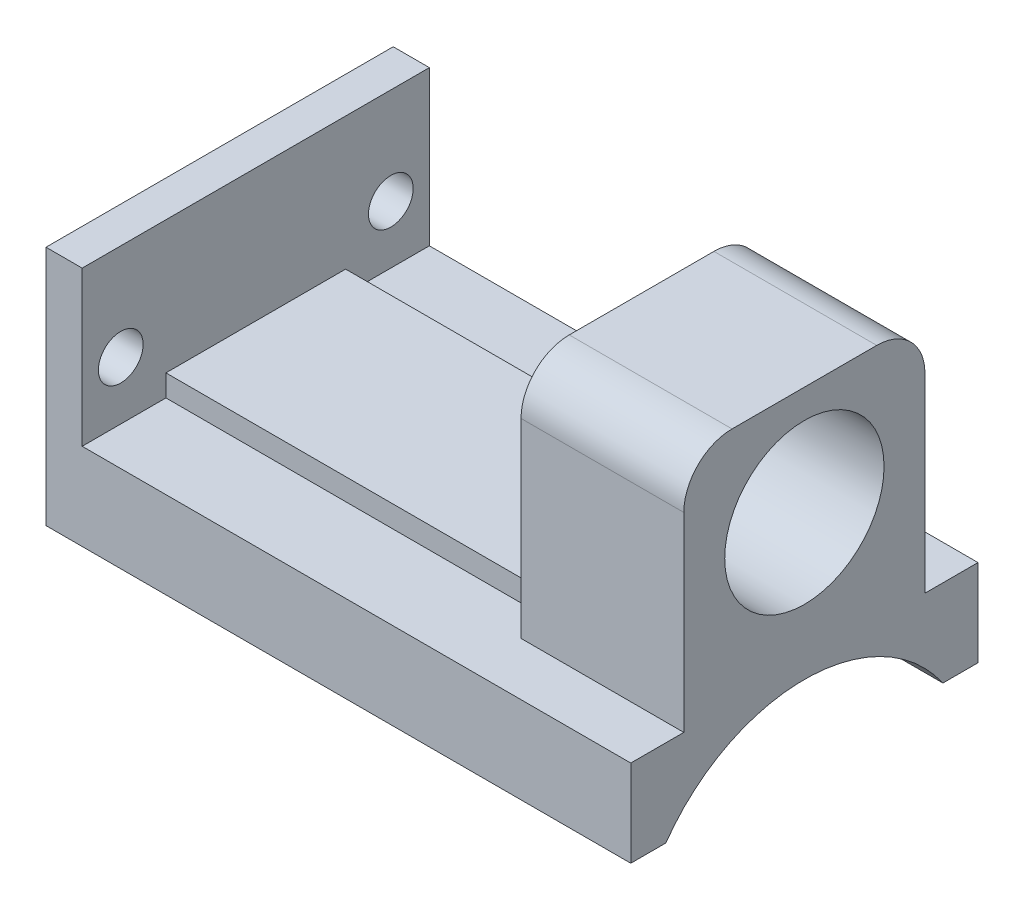
ISO-10303-21;
HEADER;
FILE_DESCRIPTION(('STEP AP214'),'2;1');
FILE_NAME('part.step','',(''),(''),'','','');
FILE_SCHEMA(('AUTOMOTIVE_DESIGN { 1 0 10303 214 1 1 1 1 }'));
ENDSEC;
DATA;
#1=APPLICATION_CONTEXT('core data for automotive mechanical design processes');
#2=APPLICATION_PROTOCOL_DEFINITION('international standard','automotive_design',2000,#1);
#3=PRODUCT_CONTEXT('',#1,'mechanical');
#4=PRODUCT('Part','Part','',(#3));
#5=PRODUCT_RELATED_PRODUCT_CATEGORY('part','',(#4));
#6=PRODUCT_DEFINITION_FORMATION('','',#4);
#7=PRODUCT_DEFINITION_CONTEXT('part definition',#1,'design');
#8=PRODUCT_DEFINITION('design','',#6,#7);
#9=PRODUCT_DEFINITION_SHAPE('','',#8);
#10=(LENGTH_UNIT() NAMED_UNIT(*) SI_UNIT(.MILLI.,.METRE.));
#11=(NAMED_UNIT(*) PLANE_ANGLE_UNIT() SI_UNIT($,.RADIAN.));
#12=(NAMED_UNIT(*) SI_UNIT($,.STERADIAN.) SOLID_ANGLE_UNIT());
#13=UNCERTAINTY_MEASURE_WITH_UNIT(LENGTH_MEASURE(1.E-05),#10,'distance_accuracy_value','');
#14=(GEOMETRIC_REPRESENTATION_CONTEXT(3) GLOBAL_UNCERTAINTY_ASSIGNED_CONTEXT((#13)) GLOBAL_UNIT_ASSIGNED_CONTEXT((#10,
#11,#12)) REPRESENTATION_CONTEXT('',''));
#15=CARTESIAN_POINT('',(0.,0.,0.));
#16=DIRECTION('',(0.,0.,1.));
#17=DIRECTION('',(1.,0.,0.));
#18=AXIS2_PLACEMENT_3D('',#15,#16,#17);
#19=CARTESIAN_POINT('',(38.50005,2.38125,-5.91581970326276));
#20=DIRECTION('',(0.,0.,1.));
#21=DIRECTION('',(1.,0.,0.));
#22=AXIS2_PLACEMENT_3D('',#19,#20,#21);
#23=PLANE('',#22);
#24=DIRECTION('',(0.,-1.,0.));
#25=VECTOR('',#24,1.);
#26=CARTESIAN_POINT('',(27.78125,0.952500000000002,-5.91581970326276));
#27=LINE('',#26,#25);
#28=CARTESIAN_POINT('',(27.78125,2.38125,-5.91581970326276));
#29=VERTEX_POINT('',#28);
#30=CARTESIAN_POINT('',(27.78125,0.952500000000002,-5.91581970326276));
#31=VERTEX_POINT('',#30);
#32=EDGE_CURVE('E620',#29,#31,#27,.T.);
#33=ORIENTED_EDGE('',*,*,#32,.T.);
#34=DIRECTION('',(-1.,0.,0.));
#35=VECTOR('',#34,1.);
#36=CARTESIAN_POINT('',(38.50005,0.952500000000002,-5.91581970326276));
#37=LINE('',#36,#35);
#38=CARTESIAN_POINT('',(2.38125,0.952500000000002,-5.91581970326276));
#39=VERTEX_POINT('',#38);
#40=EDGE_CURVE('E538',#31,#39,#37,.T.);
#41=ORIENTED_EDGE('',*,*,#40,.T.);
#42=DIRECTION('',(0.,1.,0.));
#43=VECTOR('',#42,1.);
#44=CARTESIAN_POINT('',(2.38125,2.38125,-5.91581970326276));
#45=LINE('',#44,#43);
#46=CARTESIAN_POINT('',(2.38125,2.38125,-5.91581970326276));
#47=VERTEX_POINT('',#46);
#48=EDGE_CURVE('E640',#39,#47,#45,.T.);
#49=ORIENTED_EDGE('',*,*,#48,.T.);
#50=DIRECTION('',(-1.,0.,0.));
#51=VECTOR('',#50,1.);
#52=CARTESIAN_POINT('',(38.50005,2.38125,-5.91581970326276));
#53=LINE('',#52,#51);
#54=EDGE_CURVE('E536',#29,#47,#53,.T.);
#55=ORIENTED_EDGE('',*,*,#54,.F.);
#56=EDGE_LOOP('',(#33,#41,#49,#55));
#57=FACE_BOUND('',#56,.T.);
#58=ADVANCED_FACE('F360',(#57),#23,.F.);
#59=CARTESIAN_POINT('',(38.50005,2.38125,5.91581970326276));
#60=DIRECTION('',(0.,-1.,0.));
#61=DIRECTION('',(0.,0.,-1.));
#62=AXIS2_PLACEMENT_3D('',#59,#60,#61);
#63=PLANE('',#62);
#64=DIRECTION('',(0.,0.,-1.));
#65=VECTOR('',#64,1.);
#66=CARTESIAN_POINT('',(27.78125,2.38125,-5.91581970326276));
#67=LINE('',#66,#65);
#68=CARTESIAN_POINT('',(27.78125,2.38125,5.91581970326276));
#69=VERTEX_POINT('',#68);
#70=EDGE_CURVE('E507',#69,#29,#67,.T.);
#71=ORIENTED_EDGE('',*,*,#70,.T.);
#72=ORIENTED_EDGE('',*,*,#54,.T.);
#73=DIRECTION('',(0.,0.,1.));
#74=VECTOR('',#73,1.);
#75=CARTESIAN_POINT('',(2.38125,2.38125,5.91581970326276));
#76=LINE('',#75,#74);
#77=CARTESIAN_POINT('',(2.38125,2.38125,5.91581970326276));
#78=VERTEX_POINT('',#77);
#79=EDGE_CURVE('E643',#47,#78,#76,.T.);
#80=ORIENTED_EDGE('',*,*,#79,.T.);
#81=DIRECTION('',(-1.,0.,0.));
#82=VECTOR('',#81,1.);
#83=CARTESIAN_POINT('',(38.50005,2.38125,5.91581970326276));
#84=LINE('',#83,#82);
#85=EDGE_CURVE('E534',#69,#78,#84,.T.);
#86=ORIENTED_EDGE('',*,*,#85,.F.);
#87=EDGE_LOOP('',(#71,#72,#80,#86));
#88=FACE_BOUND('',#87,.T.);
#89=ADVANCED_FACE('F674',(#88),#63,.F.);
#90=CARTESIAN_POINT('',(38.50005,2.38125,5.91581970326276));
#91=DIRECTION('',(0.,0.,-1.));
#92=DIRECTION('',(-1.,0.,0.));
#93=AXIS2_PLACEMENT_3D('',#90,#91,#92);
#94=PLANE('',#93);
#95=DIRECTION('',(0.,1.,0.));
#96=VECTOR('',#95,1.);
#97=CARTESIAN_POINT('',(27.78125,2.38125,5.91581970326276));
#98=LINE('',#97,#96);
#99=CARTESIAN_POINT('',(27.78125,0.952500000000001,5.91581970326276));
#100=VERTEX_POINT('',#99);
#101=EDGE_CURVE('E633',#100,#69,#98,.T.);
#102=ORIENTED_EDGE('',*,*,#101,.T.);
#103=ORIENTED_EDGE('',*,*,#85,.T.);
#104=DIRECTION('',(0.,-1.,0.));
#105=VECTOR('',#104,1.);
#106=CARTESIAN_POINT('',(2.38125,2.38125,5.91581970326276));
#107=LINE('',#106,#105);
#108=CARTESIAN_POINT('',(2.38125,0.952500000000001,5.91581970326276));
#109=VERTEX_POINT('',#108);
#110=EDGE_CURVE('E646',#78,#109,#107,.T.);
#111=ORIENTED_EDGE('',*,*,#110,.T.);
#112=DIRECTION('',(-1.,0.,0.));
#113=VECTOR('',#112,1.);
#114=CARTESIAN_POINT('',(38.50005,0.952500000000001,5.91581970326276));
#115=LINE('',#114,#113);
#116=EDGE_CURVE('E532',#100,#109,#115,.T.);
#117=ORIENTED_EDGE('',*,*,#116,.F.);
#118=EDGE_LOOP('',(#102,#103,#111,#117));
#119=FACE_BOUND('',#118,.T.);
#120=ADVANCED_FACE('F671',(#119),#94,.F.);
#121=CARTESIAN_POINT('',(2.38125,-4.7625,-11.43));
#122=DIRECTION('',(0.,0.,1.));
#123=DIRECTION('',(0.,-1.,0.));
#124=AXIS2_PLACEMENT_3D('',#121,#122,#123);
#125=PLANE('',#124);
#126=DIRECTION('',(0.,1.,0.));
#127=VECTOR('',#126,1.);
#128=CARTESIAN_POINT('',(0.,-4.7625,-11.43));
#129=LINE('',#128,#127);
#130=CARTESIAN_POINT('',(0.,-4.7625,-11.43));
#131=VERTEX_POINT('',#130);
#132=CARTESIAN_POINT('',(0.,11.1125,-11.43));
#133=VERTEX_POINT('',#132);
#134=EDGE_CURVE('E541',#131,#133,#129,.T.);
#135=ORIENTED_EDGE('',*,*,#134,.T.);
#136=DIRECTION('',(-1.,0.,0.));
#137=VECTOR('',#136,1.);
#138=CARTESIAN_POINT('',(2.38125,11.1125,-11.43));
#139=LINE('',#138,#137);
#140=CARTESIAN_POINT('',(2.38125,11.1125,-11.43));
#141=VERTEX_POINT('',#140);
#142=EDGE_CURVE('E562',#141,#133,#139,.T.);
#143=ORIENTED_EDGE('',*,*,#142,.F.);
#144=DIRECTION('',(0.,1.,0.));
#145=VECTOR('',#144,1.);
#146=CARTESIAN_POINT('',(2.38125,-4.7625,-11.43));
#147=LINE('',#146,#145);
#148=CARTESIAN_POINT('',(2.38125,0.952499999999999,-11.43));
#149=VERTEX_POINT('',#148);
#150=EDGE_CURVE('E554',#149,#141,#147,.T.);
#151=ORIENTED_EDGE('',*,*,#150,.F.);
#152=DIRECTION('',(-1.,0.,0.));
#153=VECTOR('',#152,1.);
#154=CARTESIAN_POINT('',(38.50005,0.952500000000003,-11.43));
#155=LINE('',#154,#153);
#156=CARTESIAN_POINT('',(38.50005,0.952500000000003,-11.43));
#157=VERTEX_POINT('',#156);
#158=EDGE_CURVE('E540',#157,#149,#155,.T.);
#159=ORIENTED_EDGE('',*,*,#158,.F.);
#160=DIRECTION('',(0.,1.,0.));
#161=VECTOR('',#160,1.);
#162=CARTESIAN_POINT('',(38.50005,-4.7625,-11.43));
#163=LINE('',#162,#161);
#164=CARTESIAN_POINT('',(38.50005,-4.7625,-11.43));
#165=VERTEX_POINT('',#164);
#166=EDGE_CURVE('E513',#165,#157,#163,.T.);
#167=ORIENTED_EDGE('',*,*,#166,.F.);
#168=DIRECTION('',(-1.,0.,0.));
#169=VECTOR('',#168,1.);
#170=CARTESIAN_POINT('',(2.38125,-4.7625,-11.43));
#171=LINE('',#170,#169);
#172=EDGE_CURVE('E566',#165,#131,#171,.T.);
#173=ORIENTED_EDGE('',*,*,#172,.T.);
#174=EDGE_LOOP('',(#135,#143,#151,#159,#167,#173));
#175=FACE_BOUND('',#174,.T.);
#176=ADVANCED_FACE('F362',(#175),#125,.F.);
#177=CARTESIAN_POINT('',(2.38125,11.1125,11.43));
#178=DIRECTION('',(0.,-1.,0.));
#179=DIRECTION('',(0.,0.,-1.));
#180=AXIS2_PLACEMENT_3D('',#177,#178,#179);
#181=PLANE('',#180);
#182=DIRECTION('',(0.,0.,1.));
#183=VECTOR('',#182,1.);
#184=CARTESIAN_POINT('',(0.,11.1125,11.43));
#185=LINE('',#184,#183);
#186=CARTESIAN_POINT('',(0.,11.1125,11.43));
#187=VERTEX_POINT('',#186);
#188=EDGE_CURVE('E544',#133,#187,#185,.T.);
#189=ORIENTED_EDGE('',*,*,#188,.T.);
#190=DIRECTION('',(-1.,0.,0.));
#191=VECTOR('',#190,1.);
#192=CARTESIAN_POINT('',(2.38125,11.1125,11.43));
#193=LINE('',#192,#191);
#194=CARTESIAN_POINT('',(2.38125,11.1125,11.43));
#195=VERTEX_POINT('',#194);
#196=EDGE_CURVE('E581',#195,#187,#193,.T.);
#197=ORIENTED_EDGE('',*,*,#196,.F.);
#198=DIRECTION('',(0.,0.,1.));
#199=VECTOR('',#198,1.);
#200=CARTESIAN_POINT('',(2.38125,11.1125,11.43));
#201=LINE('',#200,#199);
#202=EDGE_CURVE('E557',#141,#195,#201,.T.);
#203=ORIENTED_EDGE('',*,*,#202,.F.);
#204=ORIENTED_EDGE('',*,*,#142,.T.);
#205=EDGE_LOOP('',(#189,#197,#203,#204));
#206=FACE_BOUND('',#205,.T.);
#207=ADVANCED_FACE('F687',(#206),#181,.F.);
#208=CARTESIAN_POINT('',(2.38125,-4.7625,11.43));
#209=DIRECTION('',(0.,0.,-1.));
#210=DIRECTION('',(-1.,0.,0.));
#211=AXIS2_PLACEMENT_3D('',#208,#209,#210);
#212=PLANE('',#211);
#213=DIRECTION('',(0.,-1.,0.));
#214=VECTOR('',#213,1.);
#215=CARTESIAN_POINT('',(0.,-4.7625,11.43));
#216=LINE('',#215,#214);
#217=CARTESIAN_POINT('',(0.,-4.7625,11.43));
#218=VERTEX_POINT('',#217);
#219=EDGE_CURVE('E546',#187,#218,#216,.T.);
#220=ORIENTED_EDGE('',*,*,#219,.T.);
#221=DIRECTION('',(-1.,0.,0.));
#222=VECTOR('',#221,1.);
#223=CARTESIAN_POINT('',(2.38125,-4.7625,11.43));
#224=LINE('',#223,#222);
#225=CARTESIAN_POINT('',(38.50005,-4.7625,11.43));
#226=VERTEX_POINT('',#225);
#227=EDGE_CURVE('E579',#226,#218,#224,.T.);
#228=ORIENTED_EDGE('',*,*,#227,.F.);
#229=DIRECTION('',(0.,-1.,0.));
#230=VECTOR('',#229,1.);
#231=CARTESIAN_POINT('',(38.50005,0.9525,11.43));
#232=LINE('',#231,#230);
#233=CARTESIAN_POINT('',(38.50005,0.9525,11.43));
#234=VERTEX_POINT('',#233);
#235=EDGE_CURVE('E517',#234,#226,#232,.T.);
#236=ORIENTED_EDGE('',*,*,#235,.F.);
#237=DIRECTION('',(-1.,0.,0.));
#238=VECTOR('',#237,1.);
#239=CARTESIAN_POINT('',(38.50005,0.9525,11.43));
#240=LINE('',#239,#238);
#241=CARTESIAN_POINT('',(2.38125,0.952499999999997,11.43));
#242=VERTEX_POINT('',#241);
#243=EDGE_CURVE('E531',#234,#242,#240,.T.);
#244=ORIENTED_EDGE('',*,*,#243,.T.);
#245=DIRECTION('',(0.,-1.,0.));
#246=VECTOR('',#245,1.);
#247=CARTESIAN_POINT('',(2.38125,-4.7625,11.43));
#248=LINE('',#247,#246);
#249=EDGE_CURVE('E564',#195,#242,#248,.T.);
#250=ORIENTED_EDGE('',*,*,#249,.F.);
#251=ORIENTED_EDGE('',*,*,#196,.T.);
#252=EDGE_LOOP('',(#220,#228,#236,#244,#250,#251));
#253=FACE_BOUND('',#252,.T.);
#254=ADVANCED_FACE('F659',(#253),#212,.F.);
#255=CARTESIAN_POINT('',(2.38125,-4.7625,11.43));
#256=DIRECTION('',(0.,1.,0.));
#257=DIRECTION('',(0.,0.,1.));
#258=AXIS2_PLACEMENT_3D('',#255,#256,#257);
#259=PLANE('',#258);
#260=DIRECTION('',(0.,0.,-1.));
#261=VECTOR('',#260,1.);
#262=CARTESIAN_POINT('',(0.,-4.7625,11.43));
#263=LINE('',#262,#261);
#264=CARTESIAN_POINT('',(0.,-4.7625,9.11949320137912));
#265=VERTEX_POINT('',#264);
#266=EDGE_CURVE('E548',#218,#265,#263,.T.);
#267=ORIENTED_EDGE('',*,*,#266,.T.);
#268=DIRECTION('',(-1.,0.,0.));
#269=VECTOR('',#268,1.);
#270=CARTESIAN_POINT('',(2.38125,-4.7625,9.11949320137912));
#271=LINE('',#270,#269);
#272=CARTESIAN_POINT('',(38.50005,-4.7625,9.11949320137912));
#273=VERTEX_POINT('',#272);
#274=EDGE_CURVE('E576',#273,#265,#271,.T.);
#275=ORIENTED_EDGE('',*,*,#274,.F.);
#276=DIRECTION('',(0.,0.,-1.));
#277=VECTOR('',#276,1.);
#278=CARTESIAN_POINT('',(38.50005,-4.7625,11.43));
#279=LINE('',#278,#277);
#280=EDGE_CURVE('E525',#226,#273,#279,.T.);
#281=ORIENTED_EDGE('',*,*,#280,.F.);
#282=ORIENTED_EDGE('',*,*,#227,.T.);
#283=EDGE_LOOP('',(#267,#275,#281,#282));
#284=FACE_BOUND('',#283,.T.);
#285=ADVANCED_FACE('F693',(#284),#259,.F.);
#286=CARTESIAN_POINT('',(2.38125,-11.1125,0.));
#287=DIRECTION('',(-1.,0.,0.));
#288=DIRECTION('',(0.,0.,1.));
#289=AXIS2_PLACEMENT_3D('',#286,#287,#288);
#290=CYLINDRICAL_SURFACE('',#289,11.1125);
#291=CARTESIAN_POINT('',(0.,-11.1125,0.));
#292=DIRECTION('',(-1.,0.,0.));
#293=DIRECTION('',(0.,0.,-1.));
#294=AXIS2_PLACEMENT_3D('',#291,#292,#293);
#295=CIRCLE('',#294,11.1125);
#296=CARTESIAN_POINT('',(0.,-4.7625,-9.11949320137912));
#297=VERTEX_POINT('',#296);
#298=EDGE_CURVE('E550',#265,#297,#295,.T.);
#299=ORIENTED_EDGE('',*,*,#298,.T.);
#300=DIRECTION('',(-1.,0.,0.));
#301=VECTOR('',#300,1.);
#302=CARTESIAN_POINT('',(2.38125,-4.7625,-9.11949320137912));
#303=LINE('',#302,#301);
#304=CARTESIAN_POINT('',(38.50005,-4.7625,-9.11949320137912));
#305=VERTEX_POINT('',#304);
#306=EDGE_CURVE('E573',#305,#297,#303,.T.);
#307=ORIENTED_EDGE('',*,*,#306,.F.);
#308=CARTESIAN_POINT('',(38.50005,-11.1125,0.));
#309=DIRECTION('',(-1.,0.,0.));
#310=DIRECTION('',(0.,0.,-1.));
#311=AXIS2_PLACEMENT_3D('',#308,#309,#310);
#312=CIRCLE('',#311,11.1125);
#313=EDGE_CURVE('E528',#273,#305,#312,.T.);
#314=ORIENTED_EDGE('',*,*,#313,.F.);
#315=ORIENTED_EDGE('',*,*,#274,.T.);
#316=EDGE_LOOP('',(#299,#307,#314,#315));
#317=FACE_BOUND('',#316,.T.);
#318=ADVANCED_FACE('F714',(#317),#290,.F.);
#319=CARTESIAN_POINT('',(2.38125,-4.7625,-9.11949320137912));
#320=DIRECTION('',(0.,1.,0.));
#321=DIRECTION('',(0.,0.,1.));
#322=AXIS2_PLACEMENT_3D('',#319,#320,#321);
#323=PLANE('',#322);
#324=DIRECTION('',(0.,0.,-1.));
#325=VECTOR('',#324,1.);
#326=CARTESIAN_POINT('',(0.,-4.7625,-9.11949320137912));
#327=LINE('',#326,#325);
#328=EDGE_CURVE('E552',#297,#131,#327,.T.);
#329=ORIENTED_EDGE('',*,*,#328,.T.);
#330=ORIENTED_EDGE('',*,*,#172,.F.);
#331=DIRECTION('',(0.,0.,-1.));
#332=VECTOR('',#331,1.);
#333=CARTESIAN_POINT('',(38.50005,-4.7625,-9.11949320137912));
#334=LINE('',#333,#332);
#335=EDGE_CURVE('E519',#305,#165,#334,.T.);
#336=ORIENTED_EDGE('',*,*,#335,.F.);
#337=ORIENTED_EDGE('',*,*,#306,.T.);
#338=EDGE_LOOP('',(#329,#330,#336,#337));
#339=FACE_BOUND('',#338,.T.);
#340=ADVANCED_FACE('F711',(#339),#323,.F.);
#341=CARTESIAN_POINT('',(2.38125,-11.1125,0.));
#342=DIRECTION('',(1.,0.,0.));
#343=DIRECTION('',(0.,0.,-1.));
#344=AXIS2_PLACEMENT_3D('',#341,#342,#343);
#345=PLANE('',#344);
#346=CARTESIAN_POINT('',(2.38125,4.76249999999999,8.88999999999999));
#347=DIRECTION('',(1.,0.,0.));
#348=DIRECTION('',(0.,0.,-1.));
#349=AXIS2_PLACEMENT_3D('',#346,#347,#348);
#350=CIRCLE('',#349,1.4732);
#351=CARTESIAN_POINT('',(2.38125,4.76249999999999,7.41679999999999));
#352=VERTEX_POINT('',#351);
#353=EDGE_CURVE('E885',#352,#352,#350,.F.);
#354=ORIENTED_EDGE('',*,*,#353,.T.);
#355=EDGE_LOOP('',(#354));
#356=FACE_BOUND('',#355,.T.);
#357=CARTESIAN_POINT('',(2.38125,4.76249999999999,-8.89));
#358=DIRECTION('',(1.,0.,0.));
#359=DIRECTION('',(0.,0.,-1.));
#360=AXIS2_PLACEMENT_3D('',#357,#358,#359);
#361=CIRCLE('',#360,1.4732);
#362=CARTESIAN_POINT('',(2.38125,4.76249999999999,-10.3632));
#363=VERTEX_POINT('',#362);
#364=EDGE_CURVE('E879',#363,#363,#361,.F.);
#365=ORIENTED_EDGE('',*,*,#364,.T.);
#366=EDGE_LOOP('',(#365));
#367=FACE_BOUND('',#366,.T.);
#368=DIRECTION('',(0.,0.,1.));
#369=VECTOR('',#368,1.);
#370=CARTESIAN_POINT('',(2.38125,0.9525,11.43));
#371=LINE('',#370,#369);
#372=EDGE_CURVE('E649',#109,#242,#371,.T.);
#373=ORIENTED_EDGE('',*,*,#372,.F.);
#374=ORIENTED_EDGE('',*,*,#110,.F.);
#375=ORIENTED_EDGE('',*,*,#79,.F.);
#376=ORIENTED_EDGE('',*,*,#48,.F.);
#377=DIRECTION('',(0.,0.,1.));
#378=VECTOR('',#377,1.);
#379=CARTESIAN_POINT('',(2.38125,0.952500000000003,-11.43));
#380=LINE('',#379,#378);
#381=EDGE_CURVE('E567',#149,#39,#380,.T.);
#382=ORIENTED_EDGE('',*,*,#381,.F.);
#383=ORIENTED_EDGE('',*,*,#150,.T.);
#384=ORIENTED_EDGE('',*,*,#202,.T.);
#385=ORIENTED_EDGE('',*,*,#249,.T.);
#386=EDGE_LOOP('',(#373,#374,#375,#376,#382,#383,#384,#385));
#387=FACE_BOUND('',#386,.T.);
#388=ADVANCED_FACE('F668',(#356,#367,#387),#345,.T.);
#389=CARTESIAN_POINT('',(0.,-11.1125,0.));
#390=DIRECTION('',(1.,0.,0.));
#391=DIRECTION('',(0.,0.,-1.));
#392=AXIS2_PLACEMENT_3D('',#389,#390,#391);
#393=PLANE('',#392);
#394=CARTESIAN_POINT('',(0.,4.76249999999999,8.88999999999999));
#395=DIRECTION('',(-1.,0.,0.));
#396=DIRECTION('',(0.,0.,1.));
#397=AXIS2_PLACEMENT_3D('',#394,#395,#396);
#398=CIRCLE('',#397,1.4732);
#399=CARTESIAN_POINT('',(0.,4.76249999999999,10.3632));
#400=VERTEX_POINT('',#399);
#401=EDGE_CURVE('E882',#400,#400,#398,.T.);
#402=ORIENTED_EDGE('',*,*,#401,.F.);
#403=EDGE_LOOP('',(#402));
#404=FACE_BOUND('',#403,.T.);
#405=CARTESIAN_POINT('',(0.,4.76249999999999,-8.89));
#406=DIRECTION('',(-1.,0.,0.));
#407=DIRECTION('',(0.,0.,1.));
#408=AXIS2_PLACEMENT_3D('',#405,#406,#407);
#409=CIRCLE('',#408,1.4732);
#410=CARTESIAN_POINT('',(0.,4.76249999999999,-7.4168));
#411=VERTEX_POINT('',#410);
#412=EDGE_CURVE('E874',#411,#411,#409,.T.);
#413=ORIENTED_EDGE('',*,*,#412,.F.);
#414=EDGE_LOOP('',(#413));
#415=FACE_BOUND('',#414,.T.);
#416=ORIENTED_EDGE('',*,*,#134,.F.);
#417=ORIENTED_EDGE('',*,*,#328,.F.);
#418=ORIENTED_EDGE('',*,*,#298,.F.);
#419=ORIENTED_EDGE('',*,*,#266,.F.);
#420=ORIENTED_EDGE('',*,*,#219,.F.);
#421=ORIENTED_EDGE('',*,*,#188,.F.);
#422=EDGE_LOOP('',(#416,#417,#418,#419,#420,#421));
#423=FACE_BOUND('',#422,.T.);
#424=ADVANCED_FACE('F684',(#404,#415,#423),#393,.F.);
#425=CARTESIAN_POINT('',(38.50005,0.952500000000003,-11.43));
#426=DIRECTION('',(0.,-1.,0.));
#427=DIRECTION('',(0.,0.,-1.));
#428=AXIS2_PLACEMENT_3D('',#425,#426,#427);
#429=PLANE('',#428);
#430=DIRECTION('',(0.,0.,-1.));
#431=VECTOR('',#430,1.);
#432=CARTESIAN_POINT('',(27.78125,0.952500000000002,-7.9375));
#433=LINE('',#432,#431);
#434=CARTESIAN_POINT('',(27.78125,0.952500000000002,-7.9375));
#435=VERTEX_POINT('',#434);
#436=EDGE_CURVE('E505',#31,#435,#433,.T.);
#437=ORIENTED_EDGE('',*,*,#436,.T.);
#438=DIRECTION('',(1.,0.,0.));
#439=VECTOR('',#438,1.);
#440=CARTESIAN_POINT('',(27.78125,0.952500000000002,-7.9375));
#441=LINE('',#440,#439);
#442=CARTESIAN_POINT('',(38.50005,0.952500000000002,-7.9375));
#443=VERTEX_POINT('',#442);
#444=EDGE_CURVE('E489',#435,#443,#441,.T.);
#445=ORIENTED_EDGE('',*,*,#444,.T.);
#446=DIRECTION('',(0.,0.,1.));
#447=VECTOR('',#446,1.);
#448=CARTESIAN_POINT('',(38.50005,0.952500000000003,-11.43));
#449=LINE('',#448,#447);
#450=EDGE_CURVE('E503',#157,#443,#449,.T.);
#451=ORIENTED_EDGE('',*,*,#450,.F.);
#452=ORIENTED_EDGE('',*,*,#158,.T.);
#453=ORIENTED_EDGE('',*,*,#381,.T.);
#454=ORIENTED_EDGE('',*,*,#40,.F.);
#455=EDGE_LOOP('',(#437,#445,#451,#452,#453,#454));
#456=FACE_BOUND('',#455,.T.);
#457=ADVANCED_FACE('F501',(#456),#429,.F.);
#458=CARTESIAN_POINT('',(38.50005,0.9525,11.43));
#459=DIRECTION('',(0.,-1.,0.));
#460=DIRECTION('',(0.,0.,-1.));
#461=AXIS2_PLACEMENT_3D('',#458,#459,#460);
#462=PLANE('',#461);
#463=DIRECTION('',(0.,0.,1.));
#464=VECTOR('',#463,1.);
#465=CARTESIAN_POINT('',(38.50005,0.9525,11.43));
#466=LINE('',#465,#464);
#467=CARTESIAN_POINT('',(38.50005,0.9525,7.9375));
#468=VERTEX_POINT('',#467);
#469=EDGE_CURVE('E515',#468,#234,#466,.T.);
#470=ORIENTED_EDGE('',*,*,#469,.F.);
#471=DIRECTION('',(1.,0.,0.));
#472=VECTOR('',#471,1.);
#473=CARTESIAN_POINT('',(27.78125,0.9525,7.9375));
#474=LINE('',#473,#472);
#475=CARTESIAN_POINT('',(27.78125,0.9525,7.9375));
#476=VERTEX_POINT('',#475);
#477=EDGE_CURVE('E506',#476,#468,#474,.T.);
#478=ORIENTED_EDGE('',*,*,#477,.F.);
#479=DIRECTION('',(0.,0.,-1.));
#480=VECTOR('',#479,1.);
#481=CARTESIAN_POINT('',(27.78125,0.952500000000001,5.91581970326276));
#482=LINE('',#481,#480);
#483=EDGE_CURVE('E630',#476,#100,#482,.T.);
#484=ORIENTED_EDGE('',*,*,#483,.T.);
#485=ORIENTED_EDGE('',*,*,#116,.T.);
#486=ORIENTED_EDGE('',*,*,#372,.T.);
#487=ORIENTED_EDGE('',*,*,#243,.F.);
#488=EDGE_LOOP('',(#470,#478,#484,#485,#486,#487));
#489=FACE_BOUND('',#488,.T.);
#490=ADVANCED_FACE('F662',(#489),#462,.F.);
#491=CARTESIAN_POINT('',(38.50005,-11.1125,0.));
#492=DIRECTION('',(1.,0.,0.));
#493=DIRECTION('',(0.,0.,-1.));
#494=AXIS2_PLACEMENT_3D('',#491,#492,#493);
#495=PLANE('',#494);
#496=DIRECTION('',(0.,1.,0.));
#497=VECTOR('',#496,1.);
#498=CARTESIAN_POINT('',(38.50005,16.66875,-7.9375));
#499=LINE('',#498,#497);
#500=CARTESIAN_POINT('',(38.50005,13.49375,-7.9375));
#501=VERTEX_POINT('',#500);
#502=EDGE_CURVE('E485',#443,#501,#499,.T.);
#503=ORIENTED_EDGE('',*,*,#502,.T.);
#504=CARTESIAN_POINT('',(38.50005,13.49375,-4.7625));
#505=DIRECTION('',(1.,0.,0.));
#506=DIRECTION('',(0.,0.,-1.));
#507=AXIS2_PLACEMENT_3D('',#504,#505,#506);
#508=CIRCLE('',#507,3.175);
#509=CARTESIAN_POINT('',(38.50005,16.66875,-4.7625));
#510=VERTEX_POINT('',#509);
#511=EDGE_CURVE('E593',#501,#510,#508,.T.);
#512=ORIENTED_EDGE('',*,*,#511,.T.);
#513=DIRECTION('',(0.,0.,1.));
#514=VECTOR('',#513,1.);
#515=CARTESIAN_POINT('',(38.50005,16.66875,-7.9375));
#516=LINE('',#515,#514);
#517=CARTESIAN_POINT('',(38.50005,16.66875,4.76249999999999));
#518=VERTEX_POINT('',#517);
#519=EDGE_CURVE('E495',#510,#518,#516,.T.);
#520=ORIENTED_EDGE('',*,*,#519,.T.);
#521=CARTESIAN_POINT('',(38.50005,13.49375,4.76249999999999));
#522=DIRECTION('',(1.,0.,0.));
#523=DIRECTION('',(0.,0.,-1.));
#524=AXIS2_PLACEMENT_3D('',#521,#522,#523);
#525=CIRCLE('',#524,3.175);
#526=CARTESIAN_POINT('',(38.50005,13.49375,7.93749999999999));
#527=VERTEX_POINT('',#526);
#528=EDGE_CURVE('E591',#518,#527,#525,.T.);
#529=ORIENTED_EDGE('',*,*,#528,.T.);
#530=DIRECTION('',(0.,-1.,0.));
#531=VECTOR('',#530,1.);
#532=CARTESIAN_POINT('',(38.50005,16.66875,7.93749999999999));
#533=LINE('',#532,#531);
#534=EDGE_CURVE('E618',#527,#468,#533,.T.);
#535=ORIENTED_EDGE('',*,*,#534,.T.);
#536=ORIENTED_EDGE('',*,*,#469,.T.);
#537=ORIENTED_EDGE('',*,*,#235,.T.);
#538=ORIENTED_EDGE('',*,*,#280,.T.);
#539=ORIENTED_EDGE('',*,*,#313,.T.);
#540=ORIENTED_EDGE('',*,*,#335,.T.);
#541=ORIENTED_EDGE('',*,*,#166,.T.);
#542=ORIENTED_EDGE('',*,*,#450,.T.);
#543=EDGE_LOOP('',(#503,#512,#520,#529,#535,#536,#537,#538,#539,#540,#541,#542));
#544=FACE_BOUND('',#543,.T.);
#545=CARTESIAN_POINT('',(38.50005,9.525,0.));
#546=DIRECTION('',(1.,0.,0.));
#547=DIRECTION('',(0.,0.,-1.));
#548=AXIS2_PLACEMENT_3D('',#545,#546,#547);
#549=CIRCLE('',#548,5.2451);
#550=CARTESIAN_POINT('',(38.50005,9.525,-5.2451));
#551=VERTEX_POINT('',#550);
#552=EDGE_CURVE('E872',#551,#551,#549,.T.);
#553=ORIENTED_EDGE('',*,*,#552,.F.);
#554=EDGE_LOOP('',(#553));
#555=FACE_BOUND('',#554,.T.);
#556=ADVANCED_FACE('F509',(#544,#555),#495,.T.);
#557=CARTESIAN_POINT('',(27.78125,16.66875,7.93749999999999));
#558=DIRECTION('',(0.,0.,1.));
#559=DIRECTION('',(0.,-1.,0.));
#560=AXIS2_PLACEMENT_3D('',#557,#558,#559);
#561=PLANE('',#560);
#562=ORIENTED_EDGE('',*,*,#534,.F.);
#563=DIRECTION('',(1.,0.,0.));
#564=VECTOR('',#563,1.);
#565=CARTESIAN_POINT('',(27.78125,13.49375,7.93749999999999));
#566=LINE('',#565,#564);
#567=CARTESIAN_POINT('',(27.78125,13.49375,7.93749999999999));
#568=VERTEX_POINT('',#567);
#569=EDGE_CURVE('E11',#527,#568,#566,.F.);
#570=ORIENTED_EDGE('',*,*,#569,.T.);
#571=DIRECTION('',(0.,-1.,0.));
#572=VECTOR('',#571,1.);
#573=CARTESIAN_POINT('',(27.78125,16.66875,7.93749999999999));
#574=LINE('',#573,#572);
#575=EDGE_CURVE('E628',#568,#476,#574,.T.);
#576=ORIENTED_EDGE('',*,*,#575,.T.);
#577=ORIENTED_EDGE('',*,*,#477,.T.);
#578=EDGE_LOOP('',(#562,#570,#576,#577));
#579=FACE_BOUND('',#578,.T.);
#580=ADVANCED_FACE('F726',(#579),#561,.T.);
#581=CARTESIAN_POINT('',(27.78125,16.66875,-7.9375));
#582=DIRECTION('',(0.,1.,0.));
#583=DIRECTION('',(0.,0.,1.));
#584=AXIS2_PLACEMENT_3D('',#581,#582,#583);
#585=PLANE('',#584);
#586=ORIENTED_EDGE('',*,*,#519,.F.);
#587=DIRECTION('',(1.,0.,0.));
#588=VECTOR('',#587,1.);
#589=CARTESIAN_POINT('',(27.78125,16.66875,-4.7625));
#590=LINE('',#589,#588);
#591=CARTESIAN_POINT('',(27.78125,16.66875,-4.7625));
#592=VERTEX_POINT('',#591);
#593=EDGE_CURVE('E603',#510,#592,#590,.F.);
#594=ORIENTED_EDGE('',*,*,#593,.T.);
#595=DIRECTION('',(0.,0.,1.));
#596=VECTOR('',#595,1.);
#597=CARTESIAN_POINT('',(27.78125,16.66875,-7.9375));
#598=LINE('',#597,#596);
#599=CARTESIAN_POINT('',(27.78125,16.66875,4.76249999999999));
#600=VERTEX_POINT('',#599);
#601=EDGE_CURVE('E608',#592,#600,#598,.T.);
#602=ORIENTED_EDGE('',*,*,#601,.T.);
#603=DIRECTION('',(1.,0.,0.));
#604=VECTOR('',#603,1.);
#605=CARTESIAN_POINT('',(27.78125,16.66875,4.76249999999999));
#606=LINE('',#605,#604);
#607=EDGE_CURVE('E600',#600,#518,#606,.T.);
#608=ORIENTED_EDGE('',*,*,#607,.T.);
#609=EDGE_LOOP('',(#586,#594,#602,#608));
#610=FACE_BOUND('',#609,.T.);
#611=ADVANCED_FACE('F616',(#610),#585,.T.);
#612=CARTESIAN_POINT('',(27.78125,16.66875,-7.9375));
#613=DIRECTION('',(0.,0.,-1.));
#614=DIRECTION('',(0.,1.,0.));
#615=AXIS2_PLACEMENT_3D('',#612,#613,#614);
#616=PLANE('',#615);
#617=DIRECTION('',(0.,1.,0.));
#618=VECTOR('',#617,1.);
#619=CARTESIAN_POINT('',(27.78125,16.66875,-7.9375));
#620=LINE('',#619,#618);
#621=CARTESIAN_POINT('',(27.78125,13.49375,-7.9375));
#622=VERTEX_POINT('',#621);
#623=EDGE_CURVE('E607',#435,#622,#620,.T.);
#624=ORIENTED_EDGE('',*,*,#623,.T.);
#625=DIRECTION('',(1.,0.,0.));
#626=VECTOR('',#625,1.);
#627=CARTESIAN_POINT('',(27.78125,13.49375,-7.9375));
#628=LINE('',#627,#626);
#629=EDGE_CURVE('E492',#622,#501,#628,.T.);
#630=ORIENTED_EDGE('',*,*,#629,.T.);
#631=ORIENTED_EDGE('',*,*,#502,.F.);
#632=ORIENTED_EDGE('',*,*,#444,.F.);
#633=EDGE_LOOP('',(#624,#630,#631,#632));
#634=FACE_BOUND('',#633,.T.);
#635=ADVANCED_FACE('F488',(#634),#616,.T.);
#636=CARTESIAN_POINT('',(27.78125,16.66875,-5.91581970326276));
#637=DIRECTION('',(1.,0.,0.));
#638=DIRECTION('',(0.,0.,-1.));
#639=AXIS2_PLACEMENT_3D('',#636,#637,#638);
#640=PLANE('',#639);
#641=CARTESIAN_POINT('',(27.78125,9.525,0.));
#642=DIRECTION('',(1.,0.,0.));
#643=DIRECTION('',(0.,0.,-1.));
#644=AXIS2_PLACEMENT_3D('',#641,#642,#643);
#645=CIRCLE('',#644,5.2451);
#646=CARTESIAN_POINT('',(27.78125,9.525,-5.2451));
#647=VERTEX_POINT('',#646);
#648=EDGE_CURVE('E496',#647,#647,#645,.T.);
#649=ORIENTED_EDGE('',*,*,#648,.T.);
#650=EDGE_LOOP('',(#649));
#651=FACE_BOUND('',#650,.T.);
#652=ORIENTED_EDGE('',*,*,#601,.F.);
#653=CARTESIAN_POINT('',(27.78125,13.49375,-4.7625));
#654=DIRECTION('',(1.,0.,0.));
#655=DIRECTION('',(0.,0.,-1.));
#656=AXIS2_PLACEMENT_3D('',#653,#654,#655);
#657=CIRCLE('',#656,3.175);
#658=EDGE_CURVE('E368',#592,#622,#657,.F.);
#659=ORIENTED_EDGE('',*,*,#658,.T.);
#660=ORIENTED_EDGE('',*,*,#623,.F.);
#661=ORIENTED_EDGE('',*,*,#436,.F.);
#662=ORIENTED_EDGE('',*,*,#32,.F.);
#663=ORIENTED_EDGE('',*,*,#70,.F.);
#664=ORIENTED_EDGE('',*,*,#101,.F.);
#665=ORIENTED_EDGE('',*,*,#483,.F.);
#666=ORIENTED_EDGE('',*,*,#575,.F.);
#667=CARTESIAN_POINT('',(27.78125,13.49375,4.76249999999999));
#668=DIRECTION('',(1.,0.,0.));
#669=DIRECTION('',(0.,0.,-1.));
#670=AXIS2_PLACEMENT_3D('',#667,#668,#669);
#671=CIRCLE('',#670,3.175);
#672=EDGE_CURVE('E380',#568,#600,#671,.F.);
#673=ORIENTED_EDGE('',*,*,#672,.T.);
#674=EDGE_LOOP('',(#652,#659,#660,#661,#662,#663,#664,#665,#666,#673));
#675=FACE_BOUND('',#674,.T.);
#676=ADVANCED_FACE('F606',(#651,#675),#640,.F.);
#677=CARTESIAN_POINT('',(27.78125,9.525,0.));
#678=DIRECTION('',(1.,0.,0.));
#679=DIRECTION('',(0.,0.,-1.));
#680=AXIS2_PLACEMENT_3D('',#677,#678,#679);
#681=CYLINDRICAL_SURFACE('',#680,5.2451);
#682=ORIENTED_EDGE('',*,*,#648,.F.);
#683=EDGE_LOOP('',(#682));
#684=FACE_BOUND('',#683,.T.);
#685=ORIENTED_EDGE('',*,*,#552,.T.);
#686=EDGE_LOOP('',(#685));
#687=FACE_BOUND('',#686,.T.);
#688=ADVANCED_FACE('F744',(#684,#687),#681,.F.);
#689=CARTESIAN_POINT('',(38.501075,4.76249999999999,-8.89));
#690=DIRECTION('',(-1.,0.,0.));
#691=DIRECTION('',(0.,0.,1.));
#692=AXIS2_PLACEMENT_3D('',#689,#690,#691);
#693=CYLINDRICAL_SURFACE('',#692,1.4732);
#694=ORIENTED_EDGE('',*,*,#364,.F.);
#695=EDGE_LOOP('',(#694));
#696=FACE_BOUND('',#695,.T.);
#697=ORIENTED_EDGE('',*,*,#412,.T.);
#698=EDGE_LOOP('',(#697));
#699=FACE_BOUND('',#698,.T.);
#700=ADVANCED_FACE('F740',(#696,#699),#693,.F.);
#701=CARTESIAN_POINT('',(38.501075,4.76249999999999,8.88999999999999));
#702=DIRECTION('',(-1.,0.,0.));
#703=DIRECTION('',(0.,0.,1.));
#704=AXIS2_PLACEMENT_3D('',#701,#702,#703);
#705=CYLINDRICAL_SURFACE('',#704,1.4732);
#706=ORIENTED_EDGE('',*,*,#353,.F.);
#707=EDGE_LOOP('',(#706));
#708=FACE_BOUND('',#707,.T.);
#709=ORIENTED_EDGE('',*,*,#401,.T.);
#710=EDGE_LOOP('',(#709));
#711=FACE_BOUND('',#710,.T.);
#712=ADVANCED_FACE('F735',(#708,#711),#705,.F.);
#713=CARTESIAN_POINT('',(27.78125,13.49375,-4.7625));
#714=DIRECTION('',(1.,0.,0.));
#715=DIRECTION('',(0.,0.,-1.));
#716=AXIS2_PLACEMENT_3D('',#713,#714,#715);
#717=CYLINDRICAL_SURFACE('',#716,3.175);
#718=ORIENTED_EDGE('',*,*,#658,.F.);
#719=ORIENTED_EDGE('',*,*,#593,.F.);
#720=ORIENTED_EDGE('',*,*,#511,.F.);
#721=ORIENTED_EDGE('',*,*,#629,.F.);
#722=EDGE_LOOP('',(#718,#719,#720,#721));
#723=FACE_BOUND('',#722,.T.);
#724=ADVANCED_FACE('F612',(#723),#717,.T.);
#725=CARTESIAN_POINT('',(27.78125,13.49375,4.76249999999999));
#726=DIRECTION('',(1.,0.,0.));
#727=DIRECTION('',(0.,0.,-1.));
#728=AXIS2_PLACEMENT_3D('',#725,#726,#727);
#729=CYLINDRICAL_SURFACE('',#728,3.175);
#730=ORIENTED_EDGE('',*,*,#672,.F.);
#731=ORIENTED_EDGE('',*,*,#569,.F.);
#732=ORIENTED_EDGE('',*,*,#528,.F.);
#733=ORIENTED_EDGE('',*,*,#607,.F.);
#734=EDGE_LOOP('',(#730,#731,#732,#733));
#735=FACE_BOUND('',#734,.T.);
#736=ADVANCED_FACE('F729',(#735),#729,.T.);
#737=CLOSED_SHELL('',(#58,#89,#120,#176,#207,#254,#285,#318,#340,#388,#424,#457,#490,#556,#580,
#611,#635,#676,#688,#700,#712,#724,#736));
#738=MANIFOLD_SOLID_BREP('B2',#737);
#739=ADVANCED_BREP_SHAPE_REPRESENTATION('',(#18,#738),#14);
#740=SHAPE_DEFINITION_REPRESENTATION(#9,#739);
ENDSEC;
END-ISO-10303-21;
